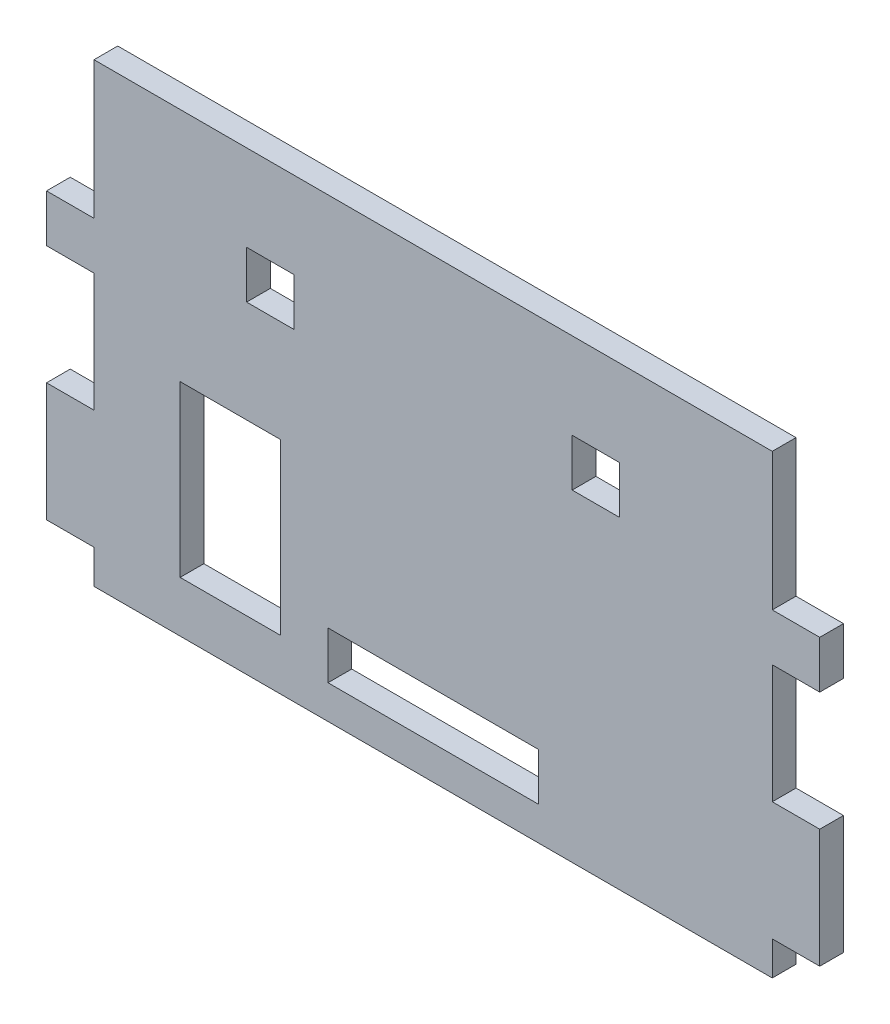
ISO-10303-21;
HEADER;
FILE_DESCRIPTION(('STEP AP214'),'2;1');
FILE_NAME('part.step','',(''),(''),'','','');
FILE_SCHEMA(('AUTOMOTIVE_DESIGN { 1 0 10303 214 1 1 1 1 }'));
ENDSEC;
DATA;
#1=APPLICATION_CONTEXT('core data for automotive mechanical design processes');
#2=APPLICATION_PROTOCOL_DEFINITION('international standard','automotive_design',2000,#1);
#3=PRODUCT_CONTEXT('',#1,'mechanical');
#4=PRODUCT('Part','Part','',(#3));
#5=PRODUCT_RELATED_PRODUCT_CATEGORY('part','',(#4));
#6=PRODUCT_DEFINITION_FORMATION('','',#4);
#7=PRODUCT_DEFINITION_CONTEXT('part definition',#1,'design');
#8=PRODUCT_DEFINITION('design','',#6,#7);
#9=PRODUCT_DEFINITION_SHAPE('','',#8);
#10=(LENGTH_UNIT() NAMED_UNIT(*) SI_UNIT(.MILLI.,.METRE.));
#11=(NAMED_UNIT(*) PLANE_ANGLE_UNIT() SI_UNIT($,.RADIAN.));
#12=(NAMED_UNIT(*) SI_UNIT($,.STERADIAN.) SOLID_ANGLE_UNIT());
#13=UNCERTAINTY_MEASURE_WITH_UNIT(LENGTH_MEASURE(1.E-05),#10,'distance_accuracy_value','');
#14=(GEOMETRIC_REPRESENTATION_CONTEXT(3) GLOBAL_UNCERTAINTY_ASSIGNED_CONTEXT((#13)) GLOBAL_UNIT_ASSIGNED_CONTEXT((#10,
#11,#12)) REPRESENTATION_CONTEXT('',''));
#15=CARTESIAN_POINT('',(0.,0.,0.));
#16=DIRECTION('',(0.,0.,1.));
#17=DIRECTION('',(1.,0.,0.));
#18=AXIS2_PLACEMENT_3D('',#15,#16,#17);
#19=CARTESIAN_POINT('',(0.,0.,7.));
#20=DIRECTION('',(0.,0.,-1.));
#21=DIRECTION('',(-1.,0.,0.));
#22=AXIS2_PLACEMENT_3D('',#19,#20,#21);
#23=PLANE('',#22);
#24=DIRECTION('',(0.,1.,0.));
#25=VECTOR('',#24,1.);
#26=CARTESIAN_POINT('',(-145.,15.,7.));
#27=LINE('',#26,#25);
#28=CARTESIAN_POINT('',(-145.,15.,7.));
#29=VERTEX_POINT('',#28);
#30=CARTESIAN_POINT('',(-145.,65.,7.));
#31=VERTEX_POINT('',#30);
#32=EDGE_CURVE('E308',#29,#31,#27,.T.);
#33=ORIENTED_EDGE('',*,*,#32,.F.);
#34=DIRECTION('',(1.,0.,0.));
#35=VECTOR('',#34,1.);
#36=CARTESIAN_POINT('',(-145.,15.,7.));
#37=LINE('',#36,#35);
#38=CARTESIAN_POINT('',(-174.6,15.,7.));
#39=VERTEX_POINT('',#38);
#40=EDGE_CURVE('E316',#39,#29,#37,.T.);
#41=ORIENTED_EDGE('',*,*,#40,.F.);
#42=DIRECTION('',(0.,-1.,0.));
#43=VECTOR('',#42,1.);
#44=CARTESIAN_POINT('',(-174.6,15.,7.));
#45=LINE('',#44,#43);
#46=CARTESIAN_POINT('',(-174.6,65.,7.));
#47=VERTEX_POINT('',#46);
#48=EDGE_CURVE('E313',#47,#39,#45,.T.);
#49=ORIENTED_EDGE('',*,*,#48,.F.);
#50=DIRECTION('',(-1.,0.,0.));
#51=VECTOR('',#50,1.);
#52=CARTESIAN_POINT('',(-145.,65.,7.));
#53=LINE('',#52,#51);
#54=EDGE_CURVE('E310',#31,#47,#53,.T.);
#55=ORIENTED_EDGE('',*,*,#54,.F.);
#56=EDGE_LOOP('',(#33,#41,#49,#55));
#57=FACE_BOUND('',#56,.T.);
#58=DIRECTION('',(0.,1.,0.));
#59=VECTOR('',#58,1.);
#60=CARTESIAN_POINT('',(-141.,109.1,7.));
#61=LINE('',#60,#59);
#62=CARTESIAN_POINT('',(-141.,95.0999999999999,7.));
#63=VERTEX_POINT('',#62);
#64=CARTESIAN_POINT('',(-141.,109.1,7.));
#65=VERTEX_POINT('',#64);
#66=EDGE_CURVE('E370',#63,#65,#61,.T.);
#67=ORIENTED_EDGE('',*,*,#66,.F.);
#68=DIRECTION('',(1.,0.,0.));
#69=VECTOR('',#68,1.);
#70=CARTESIAN_POINT('',(-155.,95.0999999999999,7.));
#71=LINE('',#70,#69);
#72=CARTESIAN_POINT('',(-155.,95.0999999999999,7.));
#73=VERTEX_POINT('',#72);
#74=EDGE_CURVE('E378',#73,#63,#71,.T.);
#75=ORIENTED_EDGE('',*,*,#74,.F.);
#76=DIRECTION('',(0.,-1.,0.));
#77=VECTOR('',#76,1.);
#78=CARTESIAN_POINT('',(-155.,109.1,7.));
#79=LINE('',#78,#77);
#80=CARTESIAN_POINT('',(-155.,109.1,7.));
#81=VERTEX_POINT('',#80);
#82=EDGE_CURVE('E375',#81,#73,#79,.T.);
#83=ORIENTED_EDGE('',*,*,#82,.F.);
#84=DIRECTION('',(-1.,0.,0.));
#85=VECTOR('',#84,1.);
#86=CARTESIAN_POINT('',(-155.,109.1,7.));
#87=LINE('',#86,#85);
#88=EDGE_CURVE('E372',#65,#81,#87,.T.);
#89=ORIENTED_EDGE('',*,*,#88,.F.);
#90=EDGE_LOOP('',(#67,#75,#83,#89));
#91=FACE_BOUND('',#90,.T.);
#92=DIRECTION('',(0.,1.,0.));
#93=VECTOR('',#92,1.);
#94=CARTESIAN_POINT('',(0.,94.,7.));
#95=LINE('',#94,#93);
#96=CARTESIAN_POINT('',(0.,94.,7.));
#97=VERTEX_POINT('',#96);
#98=CARTESIAN_POINT('',(0.,134.5,7.));
#99=VERTEX_POINT('',#98);
#100=EDGE_CURVE('E401',#97,#99,#95,.T.);
#101=ORIENTED_EDGE('',*,*,#100,.T.);
#102=DIRECTION('',(-1.,0.,0.));
#103=VECTOR('',#102,1.);
#104=CARTESIAN_POINT('',(-200.,134.5,7.));
#105=LINE('',#104,#103);
#106=CARTESIAN_POINT('',(-200.,134.5,7.));
#107=VERTEX_POINT('',#106);
#108=EDGE_CURVE('E404',#99,#107,#105,.T.);
#109=ORIENTED_EDGE('',*,*,#108,.T.);
#110=DIRECTION('',(0.,-1.,0.));
#111=VECTOR('',#110,1.);
#112=CARTESIAN_POINT('',(-200.,94.,7.));
#113=LINE('',#112,#111);
#114=CARTESIAN_POINT('',(-200.,94.,7.));
#115=VERTEX_POINT('',#114);
#116=EDGE_CURVE('E407',#107,#115,#113,.T.);
#117=ORIENTED_EDGE('',*,*,#116,.T.);
#118=DIRECTION('',(-1.,0.,0.));
#119=VECTOR('',#118,1.);
#120=CARTESIAN_POINT('',(-214.,94.,7.));
#121=LINE('',#120,#119);
#122=CARTESIAN_POINT('',(-214.,94.,7.));
#123=VERTEX_POINT('',#122);
#124=EDGE_CURVE('E409',#115,#123,#121,.T.);
#125=ORIENTED_EDGE('',*,*,#124,.T.);
#126=DIRECTION('',(0.,-1.,0.));
#127=VECTOR('',#126,1.);
#128=CARTESIAN_POINT('',(-214.,80.,7.));
#129=LINE('',#128,#127);
#130=CARTESIAN_POINT('',(-214.,80.,7.));
#131=VERTEX_POINT('',#130);
#132=EDGE_CURVE('E411',#123,#131,#129,.T.);
#133=ORIENTED_EDGE('',*,*,#132,.T.);
#134=DIRECTION('',(1.,0.,0.));
#135=VECTOR('',#134,1.);
#136=CARTESIAN_POINT('',(-214.,80.,7.));
#137=LINE('',#136,#135);
#138=CARTESIAN_POINT('',(-200.,80.,7.));
#139=VERTEX_POINT('',#138);
#140=EDGE_CURVE('E413',#131,#139,#137,.T.);
#141=ORIENTED_EDGE('',*,*,#140,.T.);
#142=DIRECTION('',(0.,-1.,0.));
#143=VECTOR('',#142,1.);
#144=CARTESIAN_POINT('',(-200.,45.,7.));
#145=LINE('',#144,#143);
#146=CARTESIAN_POINT('',(-200.,45.,7.));
#147=VERTEX_POINT('',#146);
#148=EDGE_CURVE('E415',#139,#147,#145,.T.);
#149=ORIENTED_EDGE('',*,*,#148,.T.);
#150=DIRECTION('',(-1.,0.,0.));
#151=VECTOR('',#150,1.);
#152=CARTESIAN_POINT('',(-214.,45.,7.));
#153=LINE('',#152,#151);
#154=CARTESIAN_POINT('',(-214.,45.,7.));
#155=VERTEX_POINT('',#154);
#156=EDGE_CURVE('E417',#147,#155,#153,.T.);
#157=ORIENTED_EDGE('',*,*,#156,.T.);
#158=DIRECTION('',(0.,-1.,0.));
#159=VECTOR('',#158,1.);
#160=CARTESIAN_POINT('',(-214.,10.,7.));
#161=LINE('',#160,#159);
#162=CARTESIAN_POINT('',(-214.,10.,7.));
#163=VERTEX_POINT('',#162);
#164=EDGE_CURVE('E419',#155,#163,#161,.T.);
#165=ORIENTED_EDGE('',*,*,#164,.T.);
#166=DIRECTION('',(1.,0.,0.));
#167=VECTOR('',#166,1.);
#168=CARTESIAN_POINT('',(-214.,10.,7.));
#169=LINE('',#168,#167);
#170=CARTESIAN_POINT('',(-200.,10.,7.));
#171=VERTEX_POINT('',#170);
#172=EDGE_CURVE('E421',#163,#171,#169,.T.);
#173=ORIENTED_EDGE('',*,*,#172,.T.);
#174=DIRECTION('',(0.,-1.,0.));
#175=VECTOR('',#174,1.);
#176=CARTESIAN_POINT('',(-200.,0.,7.));
#177=LINE('',#176,#175);
#178=CARTESIAN_POINT('',(-200.,0.,7.));
#179=VERTEX_POINT('',#178);
#180=EDGE_CURVE('E423',#171,#179,#177,.T.);
#181=ORIENTED_EDGE('',*,*,#180,.T.);
#182=DIRECTION('',(1.,0.,0.));
#183=VECTOR('',#182,1.);
#184=CARTESIAN_POINT('',(-200.,0.,7.));
#185=LINE('',#184,#183);
#186=CARTESIAN_POINT('',(0.,0.,7.));
#187=VERTEX_POINT('',#186);
#188=EDGE_CURVE('E425',#179,#187,#185,.T.);
#189=ORIENTED_EDGE('',*,*,#188,.T.);
#190=DIRECTION('',(0.,1.,0.));
#191=VECTOR('',#190,1.);
#192=CARTESIAN_POINT('',(0.,0.,7.));
#193=LINE('',#192,#191);
#194=CARTESIAN_POINT('',(0.,10.,7.));
#195=VERTEX_POINT('',#194);
#196=EDGE_CURVE('E427',#187,#195,#193,.T.);
#197=ORIENTED_EDGE('',*,*,#196,.T.);
#198=DIRECTION('',(1.,0.,0.));
#199=VECTOR('',#198,1.);
#200=CARTESIAN_POINT('',(0.,10.,7.));
#201=LINE('',#200,#199);
#202=CARTESIAN_POINT('',(14.,10.,7.));
#203=VERTEX_POINT('',#202);
#204=EDGE_CURVE('E429',#195,#203,#201,.T.);
#205=ORIENTED_EDGE('',*,*,#204,.T.);
#206=DIRECTION('',(0.,1.,0.));
#207=VECTOR('',#206,1.);
#208=CARTESIAN_POINT('',(14.,10.,7.));
#209=LINE('',#208,#207);
#210=CARTESIAN_POINT('',(14.,45.,7.));
#211=VERTEX_POINT('',#210);
#212=EDGE_CURVE('E431',#203,#211,#209,.T.);
#213=ORIENTED_EDGE('',*,*,#212,.T.);
#214=DIRECTION('',(-1.,0.,0.));
#215=VECTOR('',#214,1.);
#216=CARTESIAN_POINT('',(0.,45.,7.));
#217=LINE('',#216,#215);
#218=CARTESIAN_POINT('',(0.,45.,7.));
#219=VERTEX_POINT('',#218);
#220=EDGE_CURVE('E433',#211,#219,#217,.T.);
#221=ORIENTED_EDGE('',*,*,#220,.T.);
#222=DIRECTION('',(0.,1.,0.));
#223=VECTOR('',#222,1.);
#224=CARTESIAN_POINT('',(0.,45.,7.));
#225=LINE('',#224,#223);
#226=CARTESIAN_POINT('',(0.,80.,7.));
#227=VERTEX_POINT('',#226);
#228=EDGE_CURVE('E435',#219,#227,#225,.T.);
#229=ORIENTED_EDGE('',*,*,#228,.T.);
#230=DIRECTION('',(1.,0.,0.));
#231=VECTOR('',#230,1.);
#232=CARTESIAN_POINT('',(0.,80.,7.));
#233=LINE('',#232,#231);
#234=CARTESIAN_POINT('',(14.,80.,7.));
#235=VERTEX_POINT('',#234);
#236=EDGE_CURVE('E437',#227,#235,#233,.T.);
#237=ORIENTED_EDGE('',*,*,#236,.T.);
#238=DIRECTION('',(0.,1.,0.));
#239=VECTOR('',#238,1.);
#240=CARTESIAN_POINT('',(14.,80.,7.));
#241=LINE('',#240,#239);
#242=CARTESIAN_POINT('',(14.,94.,7.));
#243=VERTEX_POINT('',#242);
#244=EDGE_CURVE('E439',#235,#243,#241,.T.);
#245=ORIENTED_EDGE('',*,*,#244,.T.);
#246=DIRECTION('',(-1.,0.,0.));
#247=VECTOR('',#246,1.);
#248=CARTESIAN_POINT('',(0.,94.,7.));
#249=LINE('',#248,#247);
#250=EDGE_CURVE('E441',#243,#97,#249,.T.);
#251=ORIENTED_EDGE('',*,*,#250,.T.);
#252=EDGE_LOOP('',(#101,#109,#117,#125,#133,#141,#149,#157,#165,#173,#181,#189,#197,#205,#213,
#221,#229,#237,#245,#251));
#253=FACE_BOUND('',#252,.T.);
#254=DIRECTION('',(0.,1.,0.));
#255=VECTOR('',#254,1.);
#256=CARTESIAN_POINT('',(-45.,95.0999999999999,7.));
#257=LINE('',#256,#255);
#258=CARTESIAN_POINT('',(-45.,95.0999999999999,7.));
#259=VERTEX_POINT('',#258);
#260=CARTESIAN_POINT('',(-45.,109.1,7.));
#261=VERTEX_POINT('',#260);
#262=EDGE_CURVE('E339',#259,#261,#257,.T.);
#263=ORIENTED_EDGE('',*,*,#262,.F.);
#264=DIRECTION('',(1.,0.,0.));
#265=VECTOR('',#264,1.);
#266=CARTESIAN_POINT('',(-59.,95.0999999999999,7.));
#267=LINE('',#266,#265);
#268=CARTESIAN_POINT('',(-59.,95.0999999999999,7.));
#269=VERTEX_POINT('',#268);
#270=EDGE_CURVE('E347',#269,#259,#267,.T.);
#271=ORIENTED_EDGE('',*,*,#270,.F.);
#272=DIRECTION('',(0.,-1.,0.));
#273=VECTOR('',#272,1.);
#274=CARTESIAN_POINT('',(-59.,95.0999999999999,7.));
#275=LINE('',#274,#273);
#276=CARTESIAN_POINT('',(-59.,109.1,7.));
#277=VERTEX_POINT('',#276);
#278=EDGE_CURVE('E344',#277,#269,#275,.T.);
#279=ORIENTED_EDGE('',*,*,#278,.F.);
#280=DIRECTION('',(-1.,0.,0.));
#281=VECTOR('',#280,1.);
#282=CARTESIAN_POINT('',(-59.,109.1,7.));
#283=LINE('',#282,#281);
#284=EDGE_CURVE('E341',#261,#277,#283,.T.);
#285=ORIENTED_EDGE('',*,*,#284,.F.);
#286=EDGE_LOOP('',(#263,#271,#279,#285));
#287=FACE_BOUND('',#286,.T.);
#288=DIRECTION('',(0.,1.,0.));
#289=VECTOR('',#288,1.);
#290=CARTESIAN_POINT('',(-69.,23.9,7.));
#291=LINE('',#290,#289);
#292=CARTESIAN_POINT('',(-69.,9.9,7.));
#293=VERTEX_POINT('',#292);
#294=CARTESIAN_POINT('',(-69.,23.9,7.));
#295=VERTEX_POINT('',#294);
#296=EDGE_CURVE('E272',#293,#295,#291,.T.);
#297=ORIENTED_EDGE('',*,*,#296,.F.);
#298=DIRECTION('',(1.,0.,0.));
#299=VECTOR('',#298,1.);
#300=CARTESIAN_POINT('',(-131.,9.9,7.));
#301=LINE('',#300,#299);
#302=CARTESIAN_POINT('',(-131.,9.9,7.));
#303=VERTEX_POINT('',#302);
#304=EDGE_CURVE('E294',#303,#293,#301,.T.);
#305=ORIENTED_EDGE('',*,*,#304,.F.);
#306=DIRECTION('',(0.,-1.,0.));
#307=VECTOR('',#306,1.);
#308=CARTESIAN_POINT('',(-131.,23.9,7.));
#309=LINE('',#308,#307);
#310=CARTESIAN_POINT('',(-131.,23.9,7.));
#311=VERTEX_POINT('',#310);
#312=EDGE_CURVE('E292',#311,#303,#309,.T.);
#313=ORIENTED_EDGE('',*,*,#312,.F.);
#314=DIRECTION('',(-1.,0.,0.));
#315=VECTOR('',#314,1.);
#316=CARTESIAN_POINT('',(-131.,23.9,7.));
#317=LINE('',#316,#315);
#318=EDGE_CURVE('E280',#295,#311,#317,.T.);
#319=ORIENTED_EDGE('',*,*,#318,.F.);
#320=EDGE_LOOP('',(#297,#305,#313,#319));
#321=FACE_BOUND('',#320,.T.);
#322=ADVANCED_FACE('F39',(#57,#91,#253,#287,#321),#23,.F.);
#323=CARTESIAN_POINT('',(0.,0.,0.));
#324=DIRECTION('',(0.,0.,-1.));
#325=DIRECTION('',(-1.,0.,0.));
#326=AXIS2_PLACEMENT_3D('',#323,#324,#325);
#327=PLANE('',#326);
#328=DIRECTION('',(0.,1.,0.));
#329=VECTOR('',#328,1.);
#330=CARTESIAN_POINT('',(0.,94.,0.));
#331=LINE('',#330,#329);
#332=CARTESIAN_POINT('',(0.,94.,0.));
#333=VERTEX_POINT('',#332);
#334=CARTESIAN_POINT('',(0.,134.5,0.));
#335=VERTEX_POINT('',#334);
#336=EDGE_CURVE('E400',#333,#335,#331,.T.);
#337=ORIENTED_EDGE('',*,*,#336,.F.);
#338=DIRECTION('',(-1.,0.,0.));
#339=VECTOR('',#338,1.);
#340=CARTESIAN_POINT('',(0.,94.,0.));
#341=LINE('',#340,#339);
#342=CARTESIAN_POINT('',(14.,94.,0.));
#343=VERTEX_POINT('',#342);
#344=EDGE_CURVE('E405',#343,#333,#341,.T.);
#345=ORIENTED_EDGE('',*,*,#344,.F.);
#346=DIRECTION('',(0.,1.,0.));
#347=VECTOR('',#346,1.);
#348=CARTESIAN_POINT('',(14.,80.,0.));
#349=LINE('',#348,#347);
#350=CARTESIAN_POINT('',(14.,80.,0.));
#351=VERTEX_POINT('',#350);
#352=EDGE_CURVE('E480',#351,#343,#349,.T.);
#353=ORIENTED_EDGE('',*,*,#352,.F.);
#354=DIRECTION('',(1.,0.,0.));
#355=VECTOR('',#354,1.);
#356=CARTESIAN_POINT('',(0.,80.,0.));
#357=LINE('',#356,#355);
#358=CARTESIAN_POINT('',(0.,80.,0.));
#359=VERTEX_POINT('',#358);
#360=EDGE_CURVE('E478',#359,#351,#357,.T.);
#361=ORIENTED_EDGE('',*,*,#360,.F.);
#362=DIRECTION('',(0.,1.,0.));
#363=VECTOR('',#362,1.);
#364=CARTESIAN_POINT('',(0.,45.,0.));
#365=LINE('',#364,#363);
#366=CARTESIAN_POINT('',(0.,45.,0.));
#367=VERTEX_POINT('',#366);
#368=EDGE_CURVE('E476',#367,#359,#365,.T.);
#369=ORIENTED_EDGE('',*,*,#368,.F.);
#370=DIRECTION('',(-1.,0.,0.));
#371=VECTOR('',#370,1.);
#372=CARTESIAN_POINT('',(0.,45.,0.));
#373=LINE('',#372,#371);
#374=CARTESIAN_POINT('',(14.,45.,0.));
#375=VERTEX_POINT('',#374);
#376=EDGE_CURVE('E474',#375,#367,#373,.T.);
#377=ORIENTED_EDGE('',*,*,#376,.F.);
#378=DIRECTION('',(0.,1.,0.));
#379=VECTOR('',#378,1.);
#380=CARTESIAN_POINT('',(14.,10.,0.));
#381=LINE('',#380,#379);
#382=CARTESIAN_POINT('',(14.,10.,0.));
#383=VERTEX_POINT('',#382);
#384=EDGE_CURVE('E472',#383,#375,#381,.T.);
#385=ORIENTED_EDGE('',*,*,#384,.F.);
#386=DIRECTION('',(1.,0.,0.));
#387=VECTOR('',#386,1.);
#388=CARTESIAN_POINT('',(0.,10.,0.));
#389=LINE('',#388,#387);
#390=CARTESIAN_POINT('',(0.,10.,0.));
#391=VERTEX_POINT('',#390);
#392=EDGE_CURVE('E470',#391,#383,#389,.T.);
#393=ORIENTED_EDGE('',*,*,#392,.F.);
#394=DIRECTION('',(0.,1.,0.));
#395=VECTOR('',#394,1.);
#396=CARTESIAN_POINT('',(0.,0.,0.));
#397=LINE('',#396,#395);
#398=CARTESIAN_POINT('',(0.,0.,0.));
#399=VERTEX_POINT('',#398);
#400=EDGE_CURVE('E468',#399,#391,#397,.T.);
#401=ORIENTED_EDGE('',*,*,#400,.F.);
#402=DIRECTION('',(1.,0.,0.));
#403=VECTOR('',#402,1.);
#404=CARTESIAN_POINT('',(-200.,0.,0.));
#405=LINE('',#404,#403);
#406=CARTESIAN_POINT('',(-200.,0.,0.));
#407=VERTEX_POINT('',#406);
#408=EDGE_CURVE('E466',#407,#399,#405,.T.);
#409=ORIENTED_EDGE('',*,*,#408,.F.);
#410=DIRECTION('',(0.,-1.,0.));
#411=VECTOR('',#410,1.);
#412=CARTESIAN_POINT('',(-200.,0.,0.));
#413=LINE('',#412,#411);
#414=CARTESIAN_POINT('',(-200.,10.,0.));
#415=VERTEX_POINT('',#414);
#416=EDGE_CURVE('E464',#415,#407,#413,.T.);
#417=ORIENTED_EDGE('',*,*,#416,.F.);
#418=DIRECTION('',(1.,0.,0.));
#419=VECTOR('',#418,1.);
#420=CARTESIAN_POINT('',(-214.,10.,0.));
#421=LINE('',#420,#419);
#422=CARTESIAN_POINT('',(-214.,10.,0.));
#423=VERTEX_POINT('',#422);
#424=EDGE_CURVE('E462',#423,#415,#421,.T.);
#425=ORIENTED_EDGE('',*,*,#424,.F.);
#426=DIRECTION('',(0.,-1.,0.));
#427=VECTOR('',#426,1.);
#428=CARTESIAN_POINT('',(-214.,10.,0.));
#429=LINE('',#428,#427);
#430=CARTESIAN_POINT('',(-214.,45.,0.));
#431=VERTEX_POINT('',#430);
#432=EDGE_CURVE('E460',#431,#423,#429,.T.);
#433=ORIENTED_EDGE('',*,*,#432,.F.);
#434=DIRECTION('',(-1.,0.,0.));
#435=VECTOR('',#434,1.);
#436=CARTESIAN_POINT('',(-214.,45.,0.));
#437=LINE('',#436,#435);
#438=CARTESIAN_POINT('',(-200.,45.,0.));
#439=VERTEX_POINT('',#438);
#440=EDGE_CURVE('E458',#439,#431,#437,.T.);
#441=ORIENTED_EDGE('',*,*,#440,.F.);
#442=DIRECTION('',(0.,-1.,0.));
#443=VECTOR('',#442,1.);
#444=CARTESIAN_POINT('',(-200.,45.,0.));
#445=LINE('',#444,#443);
#446=CARTESIAN_POINT('',(-200.,80.,0.));
#447=VERTEX_POINT('',#446);
#448=EDGE_CURVE('E456',#447,#439,#445,.T.);
#449=ORIENTED_EDGE('',*,*,#448,.F.);
#450=DIRECTION('',(1.,0.,0.));
#451=VECTOR('',#450,1.);
#452=CARTESIAN_POINT('',(-214.,80.,0.));
#453=LINE('',#452,#451);
#454=CARTESIAN_POINT('',(-214.,80.,0.));
#455=VERTEX_POINT('',#454);
#456=EDGE_CURVE('E454',#455,#447,#453,.T.);
#457=ORIENTED_EDGE('',*,*,#456,.F.);
#458=DIRECTION('',(0.,-1.,0.));
#459=VECTOR('',#458,1.);
#460=CARTESIAN_POINT('',(-214.,80.,0.));
#461=LINE('',#460,#459);
#462=CARTESIAN_POINT('',(-214.,94.,0.));
#463=VERTEX_POINT('',#462);
#464=EDGE_CURVE('E452',#463,#455,#461,.T.);
#465=ORIENTED_EDGE('',*,*,#464,.F.);
#466=DIRECTION('',(-1.,0.,0.));
#467=VECTOR('',#466,1.);
#468=CARTESIAN_POINT('',(-214.,94.,0.));
#469=LINE('',#468,#467);
#470=CARTESIAN_POINT('',(-200.,94.,0.));
#471=VERTEX_POINT('',#470);
#472=EDGE_CURVE('E450',#471,#463,#469,.T.);
#473=ORIENTED_EDGE('',*,*,#472,.F.);
#474=DIRECTION('',(0.,-1.,0.));
#475=VECTOR('',#474,1.);
#476=CARTESIAN_POINT('',(-200.,94.,0.));
#477=LINE('',#476,#475);
#478=CARTESIAN_POINT('',(-200.,134.5,0.));
#479=VERTEX_POINT('',#478);
#480=EDGE_CURVE('E448',#479,#471,#477,.T.);
#481=ORIENTED_EDGE('',*,*,#480,.F.);
#482=DIRECTION('',(-1.,0.,0.));
#483=VECTOR('',#482,1.);
#484=CARTESIAN_POINT('',(-200.,134.5,0.));
#485=LINE('',#484,#483);
#486=EDGE_CURVE('E446',#335,#479,#485,.T.);
#487=ORIENTED_EDGE('',*,*,#486,.F.);
#488=EDGE_LOOP('',(#337,#345,#353,#361,#369,#377,#385,#393,#401,#409,#417,#425,#433,#441,#449,
#457,#465,#473,#481,#487));
#489=FACE_BOUND('',#488,.T.);
#490=DIRECTION('',(1.,0.,0.));
#491=VECTOR('',#490,1.);
#492=CARTESIAN_POINT('',(-155.,95.0999999999999,0.));
#493=LINE('',#492,#491);
#494=CARTESIAN_POINT('',(-155.,95.0999999999999,0.));
#495=VERTEX_POINT('',#494);
#496=CARTESIAN_POINT('',(-141.,95.0999999999999,0.));
#497=VERTEX_POINT('',#496);
#498=EDGE_CURVE('E373',#495,#497,#493,.T.);
#499=ORIENTED_EDGE('',*,*,#498,.T.);
#500=DIRECTION('',(0.,1.,0.));
#501=VECTOR('',#500,1.);
#502=CARTESIAN_POINT('',(-141.,109.1,0.));
#503=LINE('',#502,#501);
#504=CARTESIAN_POINT('',(-141.,109.1,0.));
#505=VERTEX_POINT('',#504);
#506=EDGE_CURVE('E369',#497,#505,#503,.T.);
#507=ORIENTED_EDGE('',*,*,#506,.T.);
#508=DIRECTION('',(-1.,0.,0.));
#509=VECTOR('',#508,1.);
#510=CARTESIAN_POINT('',(-155.,109.1,0.));
#511=LINE('',#510,#509);
#512=CARTESIAN_POINT('',(-155.,109.1,0.));
#513=VERTEX_POINT('',#512);
#514=EDGE_CURVE('E383',#505,#513,#511,.T.);
#515=ORIENTED_EDGE('',*,*,#514,.T.);
#516=DIRECTION('',(0.,-1.,0.));
#517=VECTOR('',#516,1.);
#518=CARTESIAN_POINT('',(-155.,109.1,0.));
#519=LINE('',#518,#517);
#520=EDGE_CURVE('E386',#513,#495,#519,.T.);
#521=ORIENTED_EDGE('',*,*,#520,.T.);
#522=EDGE_LOOP('',(#499,#507,#515,#521));
#523=FACE_BOUND('',#522,.T.);
#524=DIRECTION('',(1.,0.,0.));
#525=VECTOR('',#524,1.);
#526=CARTESIAN_POINT('',(-59.,95.0999999999999,0.));
#527=LINE('',#526,#525);
#528=CARTESIAN_POINT('',(-59.,95.0999999999999,0.));
#529=VERTEX_POINT('',#528);
#530=CARTESIAN_POINT('',(-45.,95.0999999999999,0.));
#531=VERTEX_POINT('',#530);
#532=EDGE_CURVE('E342',#529,#531,#527,.T.);
#533=ORIENTED_EDGE('',*,*,#532,.T.);
#534=DIRECTION('',(0.,1.,0.));
#535=VECTOR('',#534,1.);
#536=CARTESIAN_POINT('',(-45.,95.0999999999999,0.));
#537=LINE('',#536,#535);
#538=CARTESIAN_POINT('',(-45.,109.1,0.));
#539=VERTEX_POINT('',#538);
#540=EDGE_CURVE('E338',#531,#539,#537,.T.);
#541=ORIENTED_EDGE('',*,*,#540,.T.);
#542=DIRECTION('',(-1.,0.,0.));
#543=VECTOR('',#542,1.);
#544=CARTESIAN_POINT('',(-59.,109.1,0.));
#545=LINE('',#544,#543);
#546=CARTESIAN_POINT('',(-59.,109.1,0.));
#547=VERTEX_POINT('',#546);
#548=EDGE_CURVE('E352',#539,#547,#545,.T.);
#549=ORIENTED_EDGE('',*,*,#548,.T.);
#550=DIRECTION('',(0.,-1.,0.));
#551=VECTOR('',#550,1.);
#552=CARTESIAN_POINT('',(-59.,95.0999999999999,0.));
#553=LINE('',#552,#551);
#554=EDGE_CURVE('E355',#547,#529,#553,.T.);
#555=ORIENTED_EDGE('',*,*,#554,.T.);
#556=EDGE_LOOP('',(#533,#541,#549,#555));
#557=FACE_BOUND('',#556,.T.);
#558=DIRECTION('',(1.,0.,0.));
#559=VECTOR('',#558,1.);
#560=CARTESIAN_POINT('',(-145.,15.,0.));
#561=LINE('',#560,#559);
#562=CARTESIAN_POINT('',(-174.6,15.,0.));
#563=VERTEX_POINT('',#562);
#564=CARTESIAN_POINT('',(-145.,15.,0.));
#565=VERTEX_POINT('',#564);
#566=EDGE_CURVE('E311',#563,#565,#561,.T.);
#567=ORIENTED_EDGE('',*,*,#566,.T.);
#568=DIRECTION('',(0.,1.,0.));
#569=VECTOR('',#568,1.);
#570=CARTESIAN_POINT('',(-145.,15.,0.));
#571=LINE('',#570,#569);
#572=CARTESIAN_POINT('',(-145.,65.,0.));
#573=VERTEX_POINT('',#572);
#574=EDGE_CURVE('E288',#565,#573,#571,.T.);
#575=ORIENTED_EDGE('',*,*,#574,.T.);
#576=DIRECTION('',(-1.,0.,0.));
#577=VECTOR('',#576,1.);
#578=CARTESIAN_POINT('',(-145.,65.,0.));
#579=LINE('',#578,#577);
#580=CARTESIAN_POINT('',(-174.6,65.,0.));
#581=VERTEX_POINT('',#580);
#582=EDGE_CURVE('E321',#573,#581,#579,.T.);
#583=ORIENTED_EDGE('',*,*,#582,.T.);
#584=DIRECTION('',(0.,-1.,0.));
#585=VECTOR('',#584,1.);
#586=CARTESIAN_POINT('',(-174.6,15.,0.));
#587=LINE('',#586,#585);
#588=EDGE_CURVE('E324',#581,#563,#587,.T.);
#589=ORIENTED_EDGE('',*,*,#588,.T.);
#590=EDGE_LOOP('',(#567,#575,#583,#589));
#591=FACE_BOUND('',#590,.T.);
#592=DIRECTION('',(1.,0.,0.));
#593=VECTOR('',#592,1.);
#594=CARTESIAN_POINT('',(-131.,9.9,0.));
#595=LINE('',#594,#593);
#596=CARTESIAN_POINT('',(-131.,9.9,0.));
#597=VERTEX_POINT('',#596);
#598=CARTESIAN_POINT('',(-69.,9.9,0.));
#599=VERTEX_POINT('',#598);
#600=EDGE_CURVE('E281',#597,#599,#595,.T.);
#601=ORIENTED_EDGE('',*,*,#600,.T.);
#602=DIRECTION('',(0.,1.,0.));
#603=VECTOR('',#602,1.);
#604=CARTESIAN_POINT('',(-69.,23.9,0.));
#605=LINE('',#604,#603);
#606=CARTESIAN_POINT('',(-69.,23.9,0.));
#607=VERTEX_POINT('',#606);
#608=EDGE_CURVE('E62',#599,#607,#605,.T.);
#609=ORIENTED_EDGE('',*,*,#608,.T.);
#610=DIRECTION('',(-1.,0.,0.));
#611=VECTOR('',#610,1.);
#612=CARTESIAN_POINT('',(-131.,23.9,0.));
#613=LINE('',#612,#611);
#614=CARTESIAN_POINT('',(-131.,23.9,0.));
#615=VERTEX_POINT('',#614);
#616=EDGE_CURVE('E287',#607,#615,#613,.T.);
#617=ORIENTED_EDGE('',*,*,#616,.T.);
#618=DIRECTION('',(0.,-1.,0.));
#619=VECTOR('',#618,1.);
#620=CARTESIAN_POINT('',(-131.,23.9,0.));
#621=LINE('',#620,#619);
#622=EDGE_CURVE('E300',#615,#597,#621,.T.);
#623=ORIENTED_EDGE('',*,*,#622,.T.);
#624=EDGE_LOOP('',(#601,#609,#617,#623));
#625=FACE_BOUND('',#624,.T.);
#626=ADVANCED_FACE('F546',(#489,#523,#557,#591,#625),#327,.T.);
#627=CARTESIAN_POINT('',(0.,94.,7.));
#628=DIRECTION('',(-1.,0.,0.));
#629=DIRECTION('',(0.,0.,1.));
#630=AXIS2_PLACEMENT_3D('',#627,#628,#629);
#631=PLANE('',#630);
#632=ORIENTED_EDGE('',*,*,#336,.T.);
#633=DIRECTION('',(0.,0.,-1.));
#634=VECTOR('',#633,1.);
#635=CARTESIAN_POINT('',(0.,134.5,7.));
#636=LINE('',#635,#634);
#637=EDGE_CURVE('E11',#99,#335,#636,.T.);
#638=ORIENTED_EDGE('',*,*,#637,.F.);
#639=ORIENTED_EDGE('',*,*,#100,.F.);
#640=DIRECTION('',(0.,0.,-1.));
#641=VECTOR('',#640,1.);
#642=CARTESIAN_POINT('',(0.,94.,7.));
#643=LINE('',#642,#641);
#644=EDGE_CURVE('E443',#97,#333,#643,.T.);
#645=ORIENTED_EDGE('',*,*,#644,.T.);
#646=EDGE_LOOP('',(#632,#638,#639,#645));
#647=FACE_BOUND('',#646,.T.);
#648=ADVANCED_FACE('F41',(#647),#631,.F.);
#649=CARTESIAN_POINT('',(-200.,134.5,7.));
#650=DIRECTION('',(0.,-1.,0.));
#651=DIRECTION('',(1.,0.,0.));
#652=AXIS2_PLACEMENT_3D('',#649,#650,#651);
#653=PLANE('',#652);
#654=ORIENTED_EDGE('',*,*,#486,.T.);
#655=DIRECTION('',(0.,0.,-1.));
#656=VECTOR('',#655,1.);
#657=CARTESIAN_POINT('',(-200.,134.5,7.));
#658=LINE('',#657,#656);
#659=EDGE_CURVE('E47',#107,#479,#658,.T.);
#660=ORIENTED_EDGE('',*,*,#659,.F.);
#661=ORIENTED_EDGE('',*,*,#108,.F.);
#662=ORIENTED_EDGE('',*,*,#637,.T.);
#663=EDGE_LOOP('',(#654,#660,#661,#662));
#664=FACE_BOUND('',#663,.T.);
#665=ADVANCED_FACE('F564',(#664),#653,.F.);
#666=CARTESIAN_POINT('',(-200.,94.,7.));
#667=DIRECTION('',(1.,0.,0.));
#668=DIRECTION('',(0.,0.,-1.));
#669=AXIS2_PLACEMENT_3D('',#666,#667,#668);
#670=PLANE('',#669);
#671=ORIENTED_EDGE('',*,*,#480,.T.);
#672=DIRECTION('',(0.,0.,-1.));
#673=VECTOR('',#672,1.);
#674=CARTESIAN_POINT('',(-200.,94.,7.));
#675=LINE('',#674,#673);
#676=EDGE_CURVE('E533',#115,#471,#675,.T.);
#677=ORIENTED_EDGE('',*,*,#676,.F.);
#678=ORIENTED_EDGE('',*,*,#116,.F.);
#679=ORIENTED_EDGE('',*,*,#659,.T.);
#680=EDGE_LOOP('',(#671,#677,#678,#679));
#681=FACE_BOUND('',#680,.T.);
#682=ADVANCED_FACE('F540',(#681),#670,.F.);
#683=CARTESIAN_POINT('',(-214.,94.,7.));
#684=DIRECTION('',(0.,-1.,0.));
#685=DIRECTION('',(0.,0.,-1.));
#686=AXIS2_PLACEMENT_3D('',#683,#684,#685);
#687=PLANE('',#686);
#688=ORIENTED_EDGE('',*,*,#472,.T.);
#689=DIRECTION('',(0.,0.,-1.));
#690=VECTOR('',#689,1.);
#691=CARTESIAN_POINT('',(-214.,94.,7.));
#692=LINE('',#691,#690);
#693=EDGE_CURVE('E530',#123,#463,#692,.T.);
#694=ORIENTED_EDGE('',*,*,#693,.F.);
#695=ORIENTED_EDGE('',*,*,#124,.F.);
#696=ORIENTED_EDGE('',*,*,#676,.T.);
#697=EDGE_LOOP('',(#688,#694,#695,#696));
#698=FACE_BOUND('',#697,.T.);
#699=ADVANCED_FACE('F552',(#698),#687,.F.);
#700=CARTESIAN_POINT('',(-214.,80.,7.));
#701=DIRECTION('',(1.,0.,0.));
#702=DIRECTION('',(0.,0.,-1.));
#703=AXIS2_PLACEMENT_3D('',#700,#701,#702);
#704=PLANE('',#703);
#705=ORIENTED_EDGE('',*,*,#464,.T.);
#706=DIRECTION('',(0.,0.,-1.));
#707=VECTOR('',#706,1.);
#708=CARTESIAN_POINT('',(-214.,80.,7.));
#709=LINE('',#708,#707);
#710=EDGE_CURVE('E527',#131,#455,#709,.T.);
#711=ORIENTED_EDGE('',*,*,#710,.F.);
#712=ORIENTED_EDGE('',*,*,#132,.F.);
#713=ORIENTED_EDGE('',*,*,#693,.T.);
#714=EDGE_LOOP('',(#705,#711,#712,#713));
#715=FACE_BOUND('',#714,.T.);
#716=ADVANCED_FACE('F556',(#715),#704,.F.);
#717=CARTESIAN_POINT('',(-214.,80.,7.));
#718=DIRECTION('',(0.,1.,0.));
#719=DIRECTION('',(0.,0.,1.));
#720=AXIS2_PLACEMENT_3D('',#717,#718,#719);
#721=PLANE('',#720);
#722=ORIENTED_EDGE('',*,*,#456,.T.);
#723=DIRECTION('',(0.,0.,-1.));
#724=VECTOR('',#723,1.);
#725=CARTESIAN_POINT('',(-200.,80.,7.));
#726=LINE('',#725,#724);
#727=EDGE_CURVE('E524',#139,#447,#726,.T.);
#728=ORIENTED_EDGE('',*,*,#727,.F.);
#729=ORIENTED_EDGE('',*,*,#140,.F.);
#730=ORIENTED_EDGE('',*,*,#710,.T.);
#731=EDGE_LOOP('',(#722,#728,#729,#730));
#732=FACE_BOUND('',#731,.T.);
#733=ADVANCED_FACE('F637',(#732),#721,.F.);
#734=CARTESIAN_POINT('',(-200.,45.,7.));
#735=DIRECTION('',(1.,0.,0.));
#736=DIRECTION('',(0.,0.,-1.));
#737=AXIS2_PLACEMENT_3D('',#734,#735,#736);
#738=PLANE('',#737);
#739=ORIENTED_EDGE('',*,*,#448,.T.);
#740=DIRECTION('',(0.,0.,-1.));
#741=VECTOR('',#740,1.);
#742=CARTESIAN_POINT('',(-200.,45.,7.));
#743=LINE('',#742,#741);
#744=EDGE_CURVE('E521',#147,#439,#743,.T.);
#745=ORIENTED_EDGE('',*,*,#744,.F.);
#746=ORIENTED_EDGE('',*,*,#148,.F.);
#747=ORIENTED_EDGE('',*,*,#727,.T.);
#748=EDGE_LOOP('',(#739,#745,#746,#747));
#749=FACE_BOUND('',#748,.T.);
#750=ADVANCED_FACE('F635',(#749),#738,.F.);
#751=CARTESIAN_POINT('',(-214.,45.,7.));
#752=DIRECTION('',(0.,-1.,0.));
#753=DIRECTION('',(0.,0.,-1.));
#754=AXIS2_PLACEMENT_3D('',#751,#752,#753);
#755=PLANE('',#754);
#756=ORIENTED_EDGE('',*,*,#440,.T.);
#757=DIRECTION('',(0.,0.,-1.));
#758=VECTOR('',#757,1.);
#759=CARTESIAN_POINT('',(-214.,45.,7.));
#760=LINE('',#759,#758);
#761=EDGE_CURVE('E518',#155,#431,#760,.T.);
#762=ORIENTED_EDGE('',*,*,#761,.F.);
#763=ORIENTED_EDGE('',*,*,#156,.F.);
#764=ORIENTED_EDGE('',*,*,#744,.T.);
#765=EDGE_LOOP('',(#756,#762,#763,#764));
#766=FACE_BOUND('',#765,.T.);
#767=ADVANCED_FACE('F630',(#766),#755,.F.);
#768=CARTESIAN_POINT('',(-214.,10.,7.));
#769=DIRECTION('',(1.,0.,0.));
#770=DIRECTION('',(0.,0.,-1.));
#771=AXIS2_PLACEMENT_3D('',#768,#769,#770);
#772=PLANE('',#771);
#773=ORIENTED_EDGE('',*,*,#432,.T.);
#774=DIRECTION('',(0.,0.,-1.));
#775=VECTOR('',#774,1.);
#776=CARTESIAN_POINT('',(-214.,10.,7.));
#777=LINE('',#776,#775);
#778=EDGE_CURVE('E515',#163,#423,#777,.T.);
#779=ORIENTED_EDGE('',*,*,#778,.F.);
#780=ORIENTED_EDGE('',*,*,#164,.F.);
#781=ORIENTED_EDGE('',*,*,#761,.T.);
#782=EDGE_LOOP('',(#773,#779,#780,#781));
#783=FACE_BOUND('',#782,.T.);
#784=ADVANCED_FACE('F625',(#783),#772,.F.);
#785=CARTESIAN_POINT('',(-214.,10.,7.));
#786=DIRECTION('',(0.,1.,0.));
#787=DIRECTION('',(0.,0.,1.));
#788=AXIS2_PLACEMENT_3D('',#785,#786,#787);
#789=PLANE('',#788);
#790=ORIENTED_EDGE('',*,*,#424,.T.);
#791=DIRECTION('',(0.,0.,-1.));
#792=VECTOR('',#791,1.);
#793=CARTESIAN_POINT('',(-200.,10.,7.));
#794=LINE('',#793,#792);
#795=EDGE_CURVE('E512',#171,#415,#794,.T.);
#796=ORIENTED_EDGE('',*,*,#795,.F.);
#797=ORIENTED_EDGE('',*,*,#172,.F.);
#798=ORIENTED_EDGE('',*,*,#778,.T.);
#799=EDGE_LOOP('',(#790,#796,#797,#798));
#800=FACE_BOUND('',#799,.T.);
#801=ADVANCED_FACE('F621',(#800),#789,.F.);
#802=CARTESIAN_POINT('',(-200.,0.,7.));
#803=DIRECTION('',(1.,0.,0.));
#804=DIRECTION('',(0.,0.,-1.));
#805=AXIS2_PLACEMENT_3D('',#802,#803,#804);
#806=PLANE('',#805);
#807=ORIENTED_EDGE('',*,*,#416,.T.);
#808=DIRECTION('',(0.,0.,-1.));
#809=VECTOR('',#808,1.);
#810=CARTESIAN_POINT('',(-200.,0.,7.));
#811=LINE('',#810,#809);
#812=EDGE_CURVE('E509',#179,#407,#811,.T.);
#813=ORIENTED_EDGE('',*,*,#812,.F.);
#814=ORIENTED_EDGE('',*,*,#180,.F.);
#815=ORIENTED_EDGE('',*,*,#795,.T.);
#816=EDGE_LOOP('',(#807,#813,#814,#815));
#817=FACE_BOUND('',#816,.T.);
#818=ADVANCED_FACE('F616',(#817),#806,.F.);
#819=CARTESIAN_POINT('',(-200.,0.,7.));
#820=DIRECTION('',(0.,1.,0.));
#821=DIRECTION('',(0.,0.,1.));
#822=AXIS2_PLACEMENT_3D('',#819,#820,#821);
#823=PLANE('',#822);
#824=ORIENTED_EDGE('',*,*,#408,.T.);
#825=DIRECTION('',(0.,0.,-1.));
#826=VECTOR('',#825,1.);
#827=CARTESIAN_POINT('',(0.,0.,7.));
#828=LINE('',#827,#826);
#829=EDGE_CURVE('E506',#187,#399,#828,.T.);
#830=ORIENTED_EDGE('',*,*,#829,.F.);
#831=ORIENTED_EDGE('',*,*,#188,.F.);
#832=ORIENTED_EDGE('',*,*,#812,.T.);
#833=EDGE_LOOP('',(#824,#830,#831,#832));
#834=FACE_BOUND('',#833,.T.);
#835=ADVANCED_FACE('F610',(#834),#823,.F.);
#836=CARTESIAN_POINT('',(0.,0.,7.));
#837=DIRECTION('',(-1.,0.,0.));
#838=DIRECTION('',(0.,0.,1.));
#839=AXIS2_PLACEMENT_3D('',#836,#837,#838);
#840=PLANE('',#839);
#841=ORIENTED_EDGE('',*,*,#400,.T.);
#842=DIRECTION('',(0.,0.,-1.));
#843=VECTOR('',#842,1.);
#844=CARTESIAN_POINT('',(0.,10.,7.));
#845=LINE('',#844,#843);
#846=EDGE_CURVE('E503',#195,#391,#845,.T.);
#847=ORIENTED_EDGE('',*,*,#846,.F.);
#848=ORIENTED_EDGE('',*,*,#196,.F.);
#849=ORIENTED_EDGE('',*,*,#829,.T.);
#850=EDGE_LOOP('',(#841,#847,#848,#849));
#851=FACE_BOUND('',#850,.T.);
#852=ADVANCED_FACE('F606',(#851),#840,.F.);
#853=CARTESIAN_POINT('',(0.,10.,7.));
#854=DIRECTION('',(0.,1.,0.));
#855=DIRECTION('',(-1.,0.,0.));
#856=AXIS2_PLACEMENT_3D('',#853,#854,#855);
#857=PLANE('',#856);
#858=ORIENTED_EDGE('',*,*,#392,.T.);
#859=DIRECTION('',(0.,0.,-1.));
#860=VECTOR('',#859,1.);
#861=CARTESIAN_POINT('',(14.,10.,7.));
#862=LINE('',#861,#860);
#863=EDGE_CURVE('E500',#203,#383,#862,.T.);
#864=ORIENTED_EDGE('',*,*,#863,.F.);
#865=ORIENTED_EDGE('',*,*,#204,.F.);
#866=ORIENTED_EDGE('',*,*,#846,.T.);
#867=EDGE_LOOP('',(#858,#864,#865,#866));
#868=FACE_BOUND('',#867,.T.);
#869=ADVANCED_FACE('F601',(#868),#857,.F.);
#870=CARTESIAN_POINT('',(14.,10.,7.));
#871=DIRECTION('',(-1.,0.,0.));
#872=DIRECTION('',(0.,0.,1.));
#873=AXIS2_PLACEMENT_3D('',#870,#871,#872);
#874=PLANE('',#873);
#875=ORIENTED_EDGE('',*,*,#384,.T.);
#876=DIRECTION('',(0.,0.,-1.));
#877=VECTOR('',#876,1.);
#878=CARTESIAN_POINT('',(14.,45.,7.));
#879=LINE('',#878,#877);
#880=EDGE_CURVE('E497',#211,#375,#879,.T.);
#881=ORIENTED_EDGE('',*,*,#880,.F.);
#882=ORIENTED_EDGE('',*,*,#212,.F.);
#883=ORIENTED_EDGE('',*,*,#863,.T.);
#884=EDGE_LOOP('',(#875,#881,#882,#883));
#885=FACE_BOUND('',#884,.T.);
#886=ADVANCED_FACE('F595',(#885),#874,.F.);
#887=CARTESIAN_POINT('',(0.,45.,7.));
#888=DIRECTION('',(0.,-1.,0.));
#889=DIRECTION('',(0.,0.,-1.));
#890=AXIS2_PLACEMENT_3D('',#887,#888,#889);
#891=PLANE('',#890);
#892=ORIENTED_EDGE('',*,*,#376,.T.);
#893=DIRECTION('',(0.,0.,-1.));
#894=VECTOR('',#893,1.);
#895=CARTESIAN_POINT('',(0.,45.,7.));
#896=LINE('',#895,#894);
#897=EDGE_CURVE('E494',#219,#367,#896,.T.);
#898=ORIENTED_EDGE('',*,*,#897,.F.);
#899=ORIENTED_EDGE('',*,*,#220,.F.);
#900=ORIENTED_EDGE('',*,*,#880,.T.);
#901=EDGE_LOOP('',(#892,#898,#899,#900));
#902=FACE_BOUND('',#901,.T.);
#903=ADVANCED_FACE('F591',(#902),#891,.F.);
#904=CARTESIAN_POINT('',(0.,45.,7.));
#905=DIRECTION('',(-1.,0.,0.));
#906=DIRECTION('',(0.,0.,1.));
#907=AXIS2_PLACEMENT_3D('',#904,#905,#906);
#908=PLANE('',#907);
#909=ORIENTED_EDGE('',*,*,#368,.T.);
#910=DIRECTION('',(0.,0.,-1.));
#911=VECTOR('',#910,1.);
#912=CARTESIAN_POINT('',(0.,80.,7.));
#913=LINE('',#912,#911);
#914=EDGE_CURVE('E491',#227,#359,#913,.T.);
#915=ORIENTED_EDGE('',*,*,#914,.F.);
#916=ORIENTED_EDGE('',*,*,#228,.F.);
#917=ORIENTED_EDGE('',*,*,#897,.T.);
#918=EDGE_LOOP('',(#909,#915,#916,#917));
#919=FACE_BOUND('',#918,.T.);
#920=ADVANCED_FACE('F586',(#919),#908,.F.);
#921=CARTESIAN_POINT('',(0.,80.,7.));
#922=DIRECTION('',(0.,1.,0.));
#923=DIRECTION('',(0.,0.,1.));
#924=AXIS2_PLACEMENT_3D('',#921,#922,#923);
#925=PLANE('',#924);
#926=ORIENTED_EDGE('',*,*,#360,.T.);
#927=DIRECTION('',(0.,0.,-1.));
#928=VECTOR('',#927,1.);
#929=CARTESIAN_POINT('',(14.,80.,7.));
#930=LINE('',#929,#928);
#931=EDGE_CURVE('E488',#235,#351,#930,.T.);
#932=ORIENTED_EDGE('',*,*,#931,.F.);
#933=ORIENTED_EDGE('',*,*,#236,.F.);
#934=ORIENTED_EDGE('',*,*,#914,.T.);
#935=EDGE_LOOP('',(#926,#932,#933,#934));
#936=FACE_BOUND('',#935,.T.);
#937=ADVANCED_FACE('F580',(#936),#925,.F.);
#938=CARTESIAN_POINT('',(14.,80.,7.));
#939=DIRECTION('',(-1.,0.,0.));
#940=DIRECTION('',(0.,0.,1.));
#941=AXIS2_PLACEMENT_3D('',#938,#939,#940);
#942=PLANE('',#941);
#943=ORIENTED_EDGE('',*,*,#352,.T.);
#944=DIRECTION('',(0.,0.,-1.));
#945=VECTOR('',#944,1.);
#946=CARTESIAN_POINT('',(14.,94.,7.));
#947=LINE('',#946,#945);
#948=EDGE_CURVE('E485',#243,#343,#947,.T.);
#949=ORIENTED_EDGE('',*,*,#948,.F.);
#950=ORIENTED_EDGE('',*,*,#244,.F.);
#951=ORIENTED_EDGE('',*,*,#931,.T.);
#952=EDGE_LOOP('',(#943,#949,#950,#951));
#953=FACE_BOUND('',#952,.T.);
#954=ADVANCED_FACE('F576',(#953),#942,.F.);
#955=CARTESIAN_POINT('',(0.,94.,7.));
#956=DIRECTION('',(0.,-1.,0.));
#957=DIRECTION('',(0.,0.,-1.));
#958=AXIS2_PLACEMENT_3D('',#955,#956,#957);
#959=PLANE('',#958);
#960=ORIENTED_EDGE('',*,*,#344,.T.);
#961=ORIENTED_EDGE('',*,*,#644,.F.);
#962=ORIENTED_EDGE('',*,*,#250,.F.);
#963=ORIENTED_EDGE('',*,*,#948,.T.);
#964=EDGE_LOOP('',(#960,#961,#962,#963));
#965=FACE_BOUND('',#964,.T.);
#966=ADVANCED_FACE('F571',(#965),#959,.F.);
#967=CARTESIAN_POINT('',(-141.,109.1,7.));
#968=DIRECTION('',(-1.,0.,0.));
#969=DIRECTION('',(0.,0.,1.));
#970=AXIS2_PLACEMENT_3D('',#967,#968,#969);
#971=PLANE('',#970);
#972=ORIENTED_EDGE('',*,*,#506,.F.);
#973=DIRECTION('',(0.,0.,-1.));
#974=VECTOR('',#973,1.);
#975=CARTESIAN_POINT('',(-141.,95.0999999999999,7.));
#976=LINE('',#975,#974);
#977=EDGE_CURVE('E380',#63,#497,#976,.T.);
#978=ORIENTED_EDGE('',*,*,#977,.F.);
#979=ORIENTED_EDGE('',*,*,#66,.T.);
#980=DIRECTION('',(0.,0.,-1.));
#981=VECTOR('',#980,1.);
#982=CARTESIAN_POINT('',(-141.,109.1,7.));
#983=LINE('',#982,#981);
#984=EDGE_CURVE('E397',#65,#505,#983,.T.);
#985=ORIENTED_EDGE('',*,*,#984,.T.);
#986=EDGE_LOOP('',(#972,#978,#979,#985));
#987=FACE_BOUND('',#986,.T.);
#988=ADVANCED_FACE('F656',(#987),#971,.T.);
#989=CARTESIAN_POINT('',(-155.,109.1,7.));
#990=DIRECTION('',(0.,-1.,0.));
#991=DIRECTION('',(0.,0.,-1.));
#992=AXIS2_PLACEMENT_3D('',#989,#990,#991);
#993=PLANE('',#992);
#994=ORIENTED_EDGE('',*,*,#514,.F.);
#995=ORIENTED_EDGE('',*,*,#984,.F.);
#996=ORIENTED_EDGE('',*,*,#88,.T.);
#997=DIRECTION('',(0.,0.,-1.));
#998=VECTOR('',#997,1.);
#999=CARTESIAN_POINT('',(-155.,109.1,7.));
#1000=LINE('',#999,#998);
#1001=EDGE_CURVE('E395',#81,#513,#1000,.T.);
#1002=ORIENTED_EDGE('',*,*,#1001,.T.);
#1003=EDGE_LOOP('',(#994,#995,#996,#1002));
#1004=FACE_BOUND('',#1003,.T.);
#1005=ADVANCED_FACE('F742',(#1004),#993,.T.);
#1006=CARTESIAN_POINT('',(-155.,109.1,7.));
#1007=DIRECTION('',(1.,0.,0.));
#1008=DIRECTION('',(0.,0.,-1.));
#1009=AXIS2_PLACEMENT_3D('',#1006,#1007,#1008);
#1010=PLANE('',#1009);
#1011=ORIENTED_EDGE('',*,*,#520,.F.);
#1012=ORIENTED_EDGE('',*,*,#1001,.F.);
#1013=ORIENTED_EDGE('',*,*,#82,.T.);
#1014=DIRECTION('',(0.,0.,-1.));
#1015=VECTOR('',#1014,1.);
#1016=CARTESIAN_POINT('',(-155.,95.0999999999999,7.));
#1017=LINE('',#1016,#1015);
#1018=EDGE_CURVE('E393',#73,#495,#1017,.T.);
#1019=ORIENTED_EDGE('',*,*,#1018,.T.);
#1020=EDGE_LOOP('',(#1011,#1012,#1013,#1019));
#1021=FACE_BOUND('',#1020,.T.);
#1022=ADVANCED_FACE('F749',(#1021),#1010,.T.);
#1023=CARTESIAN_POINT('',(-155.,95.0999999999999,7.));
#1024=DIRECTION('',(0.,1.,0.));
#1025=DIRECTION('',(0.,0.,1.));
#1026=AXIS2_PLACEMENT_3D('',#1023,#1024,#1025);
#1027=PLANE('',#1026);
#1028=ORIENTED_EDGE('',*,*,#498,.F.);
#1029=ORIENTED_EDGE('',*,*,#1018,.F.);
#1030=ORIENTED_EDGE('',*,*,#74,.T.);
#1031=ORIENTED_EDGE('',*,*,#977,.T.);
#1032=EDGE_LOOP('',(#1028,#1029,#1030,#1031));
#1033=FACE_BOUND('',#1032,.T.);
#1034=ADVANCED_FACE('F756',(#1033),#1027,.T.);
#1035=CARTESIAN_POINT('',(-45.,95.0999999999999,7.));
#1036=DIRECTION('',(-1.,0.,0.));
#1037=DIRECTION('',(0.,0.,1.));
#1038=AXIS2_PLACEMENT_3D('',#1035,#1036,#1037);
#1039=PLANE('',#1038);
#1040=ORIENTED_EDGE('',*,*,#540,.F.);
#1041=DIRECTION('',(0.,0.,-1.));
#1042=VECTOR('',#1041,1.);
#1043=CARTESIAN_POINT('',(-45.,95.0999999999999,7.));
#1044=LINE('',#1043,#1042);
#1045=EDGE_CURVE('E349',#259,#531,#1044,.T.);
#1046=ORIENTED_EDGE('',*,*,#1045,.F.);
#1047=ORIENTED_EDGE('',*,*,#262,.T.);
#1048=DIRECTION('',(0.,0.,-1.));
#1049=VECTOR('',#1048,1.);
#1050=CARTESIAN_POINT('',(-45.,109.1,7.));
#1051=LINE('',#1050,#1049);
#1052=EDGE_CURVE('E366',#261,#539,#1051,.T.);
#1053=ORIENTED_EDGE('',*,*,#1052,.T.);
#1054=EDGE_LOOP('',(#1040,#1046,#1047,#1053));
#1055=FACE_BOUND('',#1054,.T.);
#1056=ADVANCED_FACE('F764',(#1055),#1039,.T.);
#1057=CARTESIAN_POINT('',(-59.,109.1,7.));
#1058=DIRECTION('',(0.,-1.,0.));
#1059=DIRECTION('',(0.,0.,-1.));
#1060=AXIS2_PLACEMENT_3D('',#1057,#1058,#1059);
#1061=PLANE('',#1060);
#1062=ORIENTED_EDGE('',*,*,#548,.F.);
#1063=ORIENTED_EDGE('',*,*,#1052,.F.);
#1064=ORIENTED_EDGE('',*,*,#284,.T.);
#1065=DIRECTION('',(0.,0.,-1.));
#1066=VECTOR('',#1065,1.);
#1067=CARTESIAN_POINT('',(-59.,109.1,7.));
#1068=LINE('',#1067,#1066);
#1069=EDGE_CURVE('E364',#277,#547,#1068,.T.);
#1070=ORIENTED_EDGE('',*,*,#1069,.T.);
#1071=EDGE_LOOP('',(#1062,#1063,#1064,#1070));
#1072=FACE_BOUND('',#1071,.T.);
#1073=ADVANCED_FACE('F772',(#1072),#1061,.T.);
#1074=CARTESIAN_POINT('',(-59.,95.0999999999999,7.));
#1075=DIRECTION('',(1.,0.,0.));
#1076=DIRECTION('',(0.,0.,-1.));
#1077=AXIS2_PLACEMENT_3D('',#1074,#1075,#1076);
#1078=PLANE('',#1077);
#1079=ORIENTED_EDGE('',*,*,#554,.F.);
#1080=ORIENTED_EDGE('',*,*,#1069,.F.);
#1081=ORIENTED_EDGE('',*,*,#278,.T.);
#1082=DIRECTION('',(0.,0.,-1.));
#1083=VECTOR('',#1082,1.);
#1084=CARTESIAN_POINT('',(-59.,95.0999999999999,7.));
#1085=LINE('',#1084,#1083);
#1086=EDGE_CURVE('E362',#269,#529,#1085,.T.);
#1087=ORIENTED_EDGE('',*,*,#1086,.T.);
#1088=EDGE_LOOP('',(#1079,#1080,#1081,#1087));
#1089=FACE_BOUND('',#1088,.T.);
#1090=ADVANCED_FACE('F780',(#1089),#1078,.T.);
#1091=CARTESIAN_POINT('',(-59.,95.0999999999999,7.));
#1092=DIRECTION('',(0.,1.,0.));
#1093=DIRECTION('',(0.,0.,1.));
#1094=AXIS2_PLACEMENT_3D('',#1091,#1092,#1093);
#1095=PLANE('',#1094);
#1096=ORIENTED_EDGE('',*,*,#532,.F.);
#1097=ORIENTED_EDGE('',*,*,#1086,.F.);
#1098=ORIENTED_EDGE('',*,*,#270,.T.);
#1099=ORIENTED_EDGE('',*,*,#1045,.T.);
#1100=EDGE_LOOP('',(#1096,#1097,#1098,#1099));
#1101=FACE_BOUND('',#1100,.T.);
#1102=ADVANCED_FACE('F788',(#1101),#1095,.T.);
#1103=CARTESIAN_POINT('',(-145.,15.,7.));
#1104=DIRECTION('',(-1.,0.,0.));
#1105=DIRECTION('',(0.,0.,1.));
#1106=AXIS2_PLACEMENT_3D('',#1103,#1104,#1105);
#1107=PLANE('',#1106);
#1108=ORIENTED_EDGE('',*,*,#574,.F.);
#1109=DIRECTION('',(0.,0.,-1.));
#1110=VECTOR('',#1109,1.);
#1111=CARTESIAN_POINT('',(-145.,15.,7.));
#1112=LINE('',#1111,#1110);
#1113=EDGE_CURVE('E318',#29,#565,#1112,.T.);
#1114=ORIENTED_EDGE('',*,*,#1113,.F.);
#1115=ORIENTED_EDGE('',*,*,#32,.T.);
#1116=DIRECTION('',(0.,0.,-1.));
#1117=VECTOR('',#1116,1.);
#1118=CARTESIAN_POINT('',(-145.,65.,7.));
#1119=LINE('',#1118,#1117);
#1120=EDGE_CURVE('E335',#31,#573,#1119,.T.);
#1121=ORIENTED_EDGE('',*,*,#1120,.T.);
#1122=EDGE_LOOP('',(#1108,#1114,#1115,#1121));
#1123=FACE_BOUND('',#1122,.T.);
#1124=ADVANCED_FACE('F796',(#1123),#1107,.T.);
#1125=CARTESIAN_POINT('',(-145.,65.,7.));
#1126=DIRECTION('',(0.,-1.,0.));
#1127=DIRECTION('',(0.,0.,-1.));
#1128=AXIS2_PLACEMENT_3D('',#1125,#1126,#1127);
#1129=PLANE('',#1128);
#1130=ORIENTED_EDGE('',*,*,#582,.F.);
#1131=ORIENTED_EDGE('',*,*,#1120,.F.);
#1132=ORIENTED_EDGE('',*,*,#54,.T.);
#1133=DIRECTION('',(0.,0.,-1.));
#1134=VECTOR('',#1133,1.);
#1135=CARTESIAN_POINT('',(-174.6,65.,7.));
#1136=LINE('',#1135,#1134);
#1137=EDGE_CURVE('E333',#47,#581,#1136,.T.);
#1138=ORIENTED_EDGE('',*,*,#1137,.T.);
#1139=EDGE_LOOP('',(#1130,#1131,#1132,#1138));
#1140=FACE_BOUND('',#1139,.T.);
#1141=ADVANCED_FACE('F804',(#1140),#1129,.T.);
#1142=CARTESIAN_POINT('',(-174.6,15.,7.));
#1143=DIRECTION('',(1.,0.,0.));
#1144=DIRECTION('',(0.,0.,-1.));
#1145=AXIS2_PLACEMENT_3D('',#1142,#1143,#1144);
#1146=PLANE('',#1145);
#1147=ORIENTED_EDGE('',*,*,#588,.F.);
#1148=ORIENTED_EDGE('',*,*,#1137,.F.);
#1149=ORIENTED_EDGE('',*,*,#48,.T.);
#1150=DIRECTION('',(0.,0.,-1.));
#1151=VECTOR('',#1150,1.);
#1152=CARTESIAN_POINT('',(-174.6,15.,7.));
#1153=LINE('',#1152,#1151);
#1154=EDGE_CURVE('E331',#39,#563,#1153,.T.);
#1155=ORIENTED_EDGE('',*,*,#1154,.T.);
#1156=EDGE_LOOP('',(#1147,#1148,#1149,#1155));
#1157=FACE_BOUND('',#1156,.T.);
#1158=ADVANCED_FACE('F812',(#1157),#1146,.T.);
#1159=CARTESIAN_POINT('',(-145.,15.,7.));
#1160=DIRECTION('',(0.,1.,0.));
#1161=DIRECTION('',(-1.,0.,0.));
#1162=AXIS2_PLACEMENT_3D('',#1159,#1160,#1161);
#1163=PLANE('',#1162);
#1164=ORIENTED_EDGE('',*,*,#566,.F.);
#1165=ORIENTED_EDGE('',*,*,#1154,.F.);
#1166=ORIENTED_EDGE('',*,*,#40,.T.);
#1167=ORIENTED_EDGE('',*,*,#1113,.T.);
#1168=EDGE_LOOP('',(#1164,#1165,#1166,#1167));
#1169=FACE_BOUND('',#1168,.T.);
#1170=ADVANCED_FACE('F820',(#1169),#1163,.T.);
#1171=CARTESIAN_POINT('',(-69.,23.9,7.));
#1172=DIRECTION('',(-1.,0.,0.));
#1173=DIRECTION('',(0.,0.,1.));
#1174=AXIS2_PLACEMENT_3D('',#1171,#1172,#1173);
#1175=PLANE('',#1174);
#1176=ORIENTED_EDGE('',*,*,#608,.F.);
#1177=DIRECTION('',(0.,0.,-1.));
#1178=VECTOR('',#1177,1.);
#1179=CARTESIAN_POINT('',(-69.,9.9,7.));
#1180=LINE('',#1179,#1178);
#1181=EDGE_CURVE('E276',#293,#599,#1180,.T.);
#1182=ORIENTED_EDGE('',*,*,#1181,.F.);
#1183=ORIENTED_EDGE('',*,*,#296,.T.);
#1184=DIRECTION('',(0.,0.,-1.));
#1185=VECTOR('',#1184,1.);
#1186=CARTESIAN_POINT('',(-69.,23.9,7.));
#1187=LINE('',#1186,#1185);
#1188=EDGE_CURVE('E275',#295,#607,#1187,.T.);
#1189=ORIENTED_EDGE('',*,*,#1188,.T.);
#1190=EDGE_LOOP('',(#1176,#1182,#1183,#1189));
#1191=FACE_BOUND('',#1190,.T.);
#1192=ADVANCED_FACE('F274',(#1191),#1175,.T.);
#1193=CARTESIAN_POINT('',(-131.,23.9,7.));
#1194=DIRECTION('',(0.,-1.,0.));
#1195=DIRECTION('',(0.,0.,-1.));
#1196=AXIS2_PLACEMENT_3D('',#1193,#1194,#1195);
#1197=PLANE('',#1196);
#1198=ORIENTED_EDGE('',*,*,#616,.F.);
#1199=ORIENTED_EDGE('',*,*,#1188,.F.);
#1200=ORIENTED_EDGE('',*,*,#318,.T.);
#1201=DIRECTION('',(0.,0.,-1.));
#1202=VECTOR('',#1201,1.);
#1203=CARTESIAN_POINT('',(-131.,23.9,7.));
#1204=LINE('',#1203,#1202);
#1205=EDGE_CURVE('E289',#311,#615,#1204,.T.);
#1206=ORIENTED_EDGE('',*,*,#1205,.T.);
#1207=EDGE_LOOP('',(#1198,#1199,#1200,#1206));
#1208=FACE_BOUND('',#1207,.T.);
#1209=ADVANCED_FACE('F284',(#1208),#1197,.T.);
#1210=CARTESIAN_POINT('',(-131.,23.9,7.));
#1211=DIRECTION('',(1.,0.,0.));
#1212=DIRECTION('',(0.,0.,-1.));
#1213=AXIS2_PLACEMENT_3D('',#1210,#1211,#1212);
#1214=PLANE('',#1213);
#1215=ORIENTED_EDGE('',*,*,#622,.F.);
#1216=ORIENTED_EDGE('',*,*,#1205,.F.);
#1217=ORIENTED_EDGE('',*,*,#312,.T.);
#1218=DIRECTION('',(0.,0.,-1.));
#1219=VECTOR('',#1218,1.);
#1220=CARTESIAN_POINT('',(-131.,9.9,7.));
#1221=LINE('',#1220,#1219);
#1222=EDGE_CURVE('E54',#303,#597,#1221,.T.);
#1223=ORIENTED_EDGE('',*,*,#1222,.T.);
#1224=EDGE_LOOP('',(#1215,#1216,#1217,#1223));
#1225=FACE_BOUND('',#1224,.T.);
#1226=ADVANCED_FACE('F841',(#1225),#1214,.T.);
#1227=CARTESIAN_POINT('',(-131.,9.9,7.));
#1228=DIRECTION('',(0.,1.,0.));
#1229=DIRECTION('',(-1.,0.,0.));
#1230=AXIS2_PLACEMENT_3D('',#1227,#1228,#1229);
#1231=PLANE('',#1230);
#1232=ORIENTED_EDGE('',*,*,#600,.F.);
#1233=ORIENTED_EDGE('',*,*,#1222,.F.);
#1234=ORIENTED_EDGE('',*,*,#304,.T.);
#1235=ORIENTED_EDGE('',*,*,#1181,.T.);
#1236=EDGE_LOOP('',(#1232,#1233,#1234,#1235));
#1237=FACE_BOUND('',#1236,.T.);
#1238=ADVANCED_FACE('F848',(#1237),#1231,.T.);
#1239=CLOSED_SHELL('',(#322,#626,#648,#665,#682,#699,#716,#733,#750,#767,#784,#801,#818,#835,
#852,#869,#886,#903,#920,#937,#954,#966,#988,#1005,#1022,#1034,#1056,#1073,#1090,#1102,#1124,
#1141,#1158,#1170,#1192,#1209,#1226,#1238));
#1240=MANIFOLD_SOLID_BREP('B2',#1239);
#1241=ADVANCED_BREP_SHAPE_REPRESENTATION('',(#18,#1240),#14);
#1242=SHAPE_DEFINITION_REPRESENTATION(#9,#1241);
ENDSEC;
END-ISO-10303-21;
